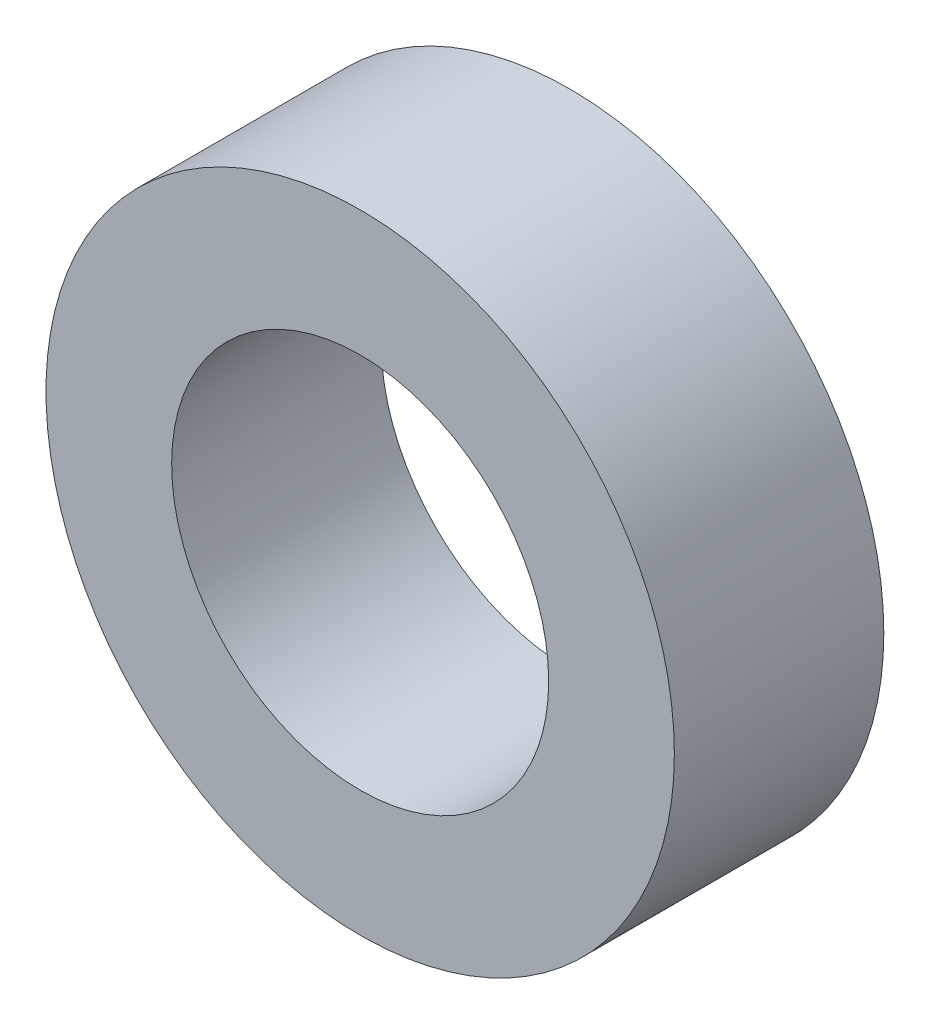
ISO-10303-21;
HEADER;
FILE_DESCRIPTION(('STEP AP214'),'2;1');
FILE_NAME('part.step','',(''),(''),'','','');
FILE_SCHEMA(('AUTOMOTIVE_DESIGN { 1 0 10303 214 1 1 1 1 }'));
ENDSEC;
DATA;
#1=APPLICATION_CONTEXT('core data for automotive mechanical design processes');
#2=APPLICATION_PROTOCOL_DEFINITION('international standard','automotive_design',2000,#1);
#3=PRODUCT_CONTEXT('',#1,'mechanical');
#4=PRODUCT('Part','Part','',(#3));
#5=PRODUCT_RELATED_PRODUCT_CATEGORY('part','',(#4));
#6=PRODUCT_DEFINITION_FORMATION('','',#4);
#7=PRODUCT_DEFINITION_CONTEXT('part definition',#1,'design');
#8=PRODUCT_DEFINITION('design','',#6,#7);
#9=PRODUCT_DEFINITION_SHAPE('','',#8);
#10=(LENGTH_UNIT() NAMED_UNIT(*) SI_UNIT(.MILLI.,.METRE.));
#11=(NAMED_UNIT(*) PLANE_ANGLE_UNIT() SI_UNIT($,.RADIAN.));
#12=(NAMED_UNIT(*) SI_UNIT($,.STERADIAN.) SOLID_ANGLE_UNIT());
#13=UNCERTAINTY_MEASURE_WITH_UNIT(LENGTH_MEASURE(1.E-05),#10,'distance_accuracy_value','');
#14=(GEOMETRIC_REPRESENTATION_CONTEXT(3) GLOBAL_UNCERTAINTY_ASSIGNED_CONTEXT((#13)) GLOBAL_UNIT_ASSIGNED_CONTEXT((#10,
#11,#12)) REPRESENTATION_CONTEXT('',''));
#15=CARTESIAN_POINT('',(0.,0.,0.));
#16=DIRECTION('',(0.,0.,1.));
#17=DIRECTION('',(1.,0.,0.));
#18=AXIS2_PLACEMENT_3D('',#15,#16,#17);
#19=CARTESIAN_POINT('',(0.,0.,5.));
#20=DIRECTION('',(0.,0.,1.));
#21=DIRECTION('',(1.,0.,0.));
#22=AXIS2_PLACEMENT_3D('',#19,#20,#21);
#23=PLANE('',#22);
#24=CARTESIAN_POINT('',(0.,0.,5.));
#25=DIRECTION('',(0.,0.,1.));
#26=DIRECTION('',(1.,0.,0.));
#27=AXIS2_PLACEMENT_3D('',#24,#25,#26);
#28=CIRCLE('',#27,15.);
#29=CARTESIAN_POINT('',(15.,0.,5.));
#30=VERTEX_POINT('',#29);
#31=EDGE_CURVE('E10',#30,#30,#28,.T.);
#32=ORIENTED_EDGE('',*,*,#31,.T.);
#33=EDGE_LOOP('',(#32));
#34=FACE_BOUND('',#33,.T.);
#35=CARTESIAN_POINT('',(0.,0.,5.));
#36=DIRECTION('',(0.,0.,1.));
#37=DIRECTION('',(1.,0.,0.));
#38=AXIS2_PLACEMENT_3D('',#35,#36,#37);
#39=CIRCLE('',#38,9.);
#40=CARTESIAN_POINT('',(9.,0.,5.));
#41=VERTEX_POINT('',#40);
#42=EDGE_CURVE('E44',#41,#41,#39,.T.);
#43=ORIENTED_EDGE('',*,*,#42,.F.);
#44=EDGE_LOOP('',(#43));
#45=FACE_BOUND('',#44,.T.);
#46=ADVANCED_FACE('F33',(#34,#45),#23,.T.);
#47=CARTESIAN_POINT('',(0.,0.,-5.));
#48=DIRECTION('',(0.,0.,1.));
#49=DIRECTION('',(1.,0.,0.));
#50=AXIS2_PLACEMENT_3D('',#47,#48,#49);
#51=PLANE('',#50);
#52=CARTESIAN_POINT('',(0.,0.,-5.));
#53=DIRECTION('',(0.,0.,1.));
#54=DIRECTION('',(1.,0.,0.));
#55=AXIS2_PLACEMENT_3D('',#52,#53,#54);
#56=CIRCLE('',#55,15.);
#57=CARTESIAN_POINT('',(15.,0.,-5.));
#58=VERTEX_POINT('',#57);
#59=EDGE_CURVE('E37',#58,#58,#56,.T.);
#60=ORIENTED_EDGE('',*,*,#59,.F.);
#61=EDGE_LOOP('',(#60));
#62=FACE_BOUND('',#61,.T.);
#63=CARTESIAN_POINT('',(0.,0.,-5.));
#64=DIRECTION('',(0.,0.,1.));
#65=DIRECTION('',(1.,0.,0.));
#66=AXIS2_PLACEMENT_3D('',#63,#64,#65);
#67=CIRCLE('',#66,9.);
#68=CARTESIAN_POINT('',(9.,0.,-5.));
#69=VERTEX_POINT('',#68);
#70=EDGE_CURVE('E46',#69,#69,#67,.T.);
#71=ORIENTED_EDGE('',*,*,#70,.T.);
#72=EDGE_LOOP('',(#71));
#73=FACE_BOUND('',#72,.T.);
#74=ADVANCED_FACE('F56',(#62,#73),#51,.F.);
#75=CARTESIAN_POINT('',(0.,0.,5.));
#76=DIRECTION('',(0.,0.,-1.));
#77=DIRECTION('',(-1.,0.,0.));
#78=AXIS2_PLACEMENT_3D('',#75,#76,#77);
#79=CYLINDRICAL_SURFACE('',#78,15.);
#80=ORIENTED_EDGE('',*,*,#31,.F.);
#81=EDGE_LOOP('',(#80));
#82=FACE_BOUND('',#81,.T.);
#83=ORIENTED_EDGE('',*,*,#59,.T.);
#84=EDGE_LOOP('',(#83));
#85=FACE_BOUND('',#84,.T.);
#86=ADVANCED_FACE('F35',(#82,#85),#79,.T.);
#87=CARTESIAN_POINT('',(0.,0.,5.));
#88=DIRECTION('',(0.,0.,-1.));
#89=DIRECTION('',(-1.,0.,0.));
#90=AXIS2_PLACEMENT_3D('',#87,#88,#89);
#91=CYLINDRICAL_SURFACE('',#90,9.);
#92=ORIENTED_EDGE('',*,*,#42,.T.);
#93=EDGE_LOOP('',(#92));
#94=FACE_BOUND('',#93,.T.);
#95=ORIENTED_EDGE('',*,*,#70,.F.);
#96=EDGE_LOOP('',(#95));
#97=FACE_BOUND('',#96,.T.);
#98=ADVANCED_FACE('F52',(#94,#97),#91,.F.);
#99=CLOSED_SHELL('',(#46,#74,#86,#98));
#100=MANIFOLD_SOLID_BREP('B2',#99);
#101=ADVANCED_BREP_SHAPE_REPRESENTATION('',(#18,#100),#14);
#102=SHAPE_DEFINITION_REPRESENTATION(#9,#101);
ENDSEC;
END-ISO-10303-21;
